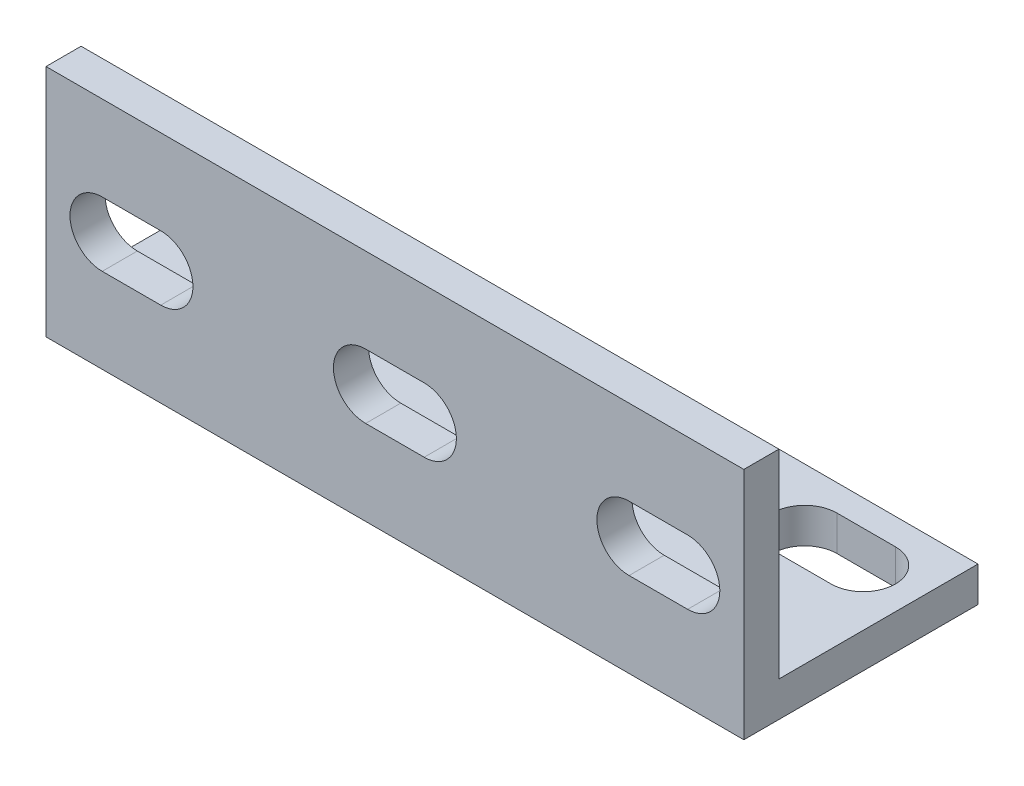
ISO-10303-21;
HEADER;
FILE_DESCRIPTION(('STEP AP214'),'2;1');
FILE_NAME('part.step','',(''),(''),'','','');
FILE_SCHEMA(('AUTOMOTIVE_DESIGN { 1 0 10303 214 1 1 1 1 }'));
ENDSEC;
DATA;
#1=APPLICATION_CONTEXT('core data for automotive mechanical design processes');
#2=APPLICATION_PROTOCOL_DEFINITION('international standard','automotive_design',2000,#1);
#3=PRODUCT_CONTEXT('',#1,'mechanical');
#4=PRODUCT('Part','Part','',(#3));
#5=PRODUCT_RELATED_PRODUCT_CATEGORY('part','',(#4));
#6=PRODUCT_DEFINITION_FORMATION('','',#4);
#7=PRODUCT_DEFINITION_CONTEXT('part definition',#1,'design');
#8=PRODUCT_DEFINITION('design','',#6,#7);
#9=PRODUCT_DEFINITION_SHAPE('','',#8);
#10=(LENGTH_UNIT() NAMED_UNIT(*) SI_UNIT(.MILLI.,.METRE.));
#11=(NAMED_UNIT(*) PLANE_ANGLE_UNIT() SI_UNIT($,.RADIAN.));
#12=(NAMED_UNIT(*) SI_UNIT($,.STERADIAN.) SOLID_ANGLE_UNIT());
#13=UNCERTAINTY_MEASURE_WITH_UNIT(LENGTH_MEASURE(1.E-05),#10,'distance_accuracy_value','');
#14=(GEOMETRIC_REPRESENTATION_CONTEXT(3) GLOBAL_UNCERTAINTY_ASSIGNED_CONTEXT((#13)) GLOBAL_UNIT_ASSIGNED_CONTEXT((#10,
#11,#12)) REPRESENTATION_CONTEXT('',''));
#15=CARTESIAN_POINT('',(0.,0.,0.));
#16=DIRECTION('',(0.,0.,1.));
#17=DIRECTION('',(1.,0.,0.));
#18=AXIS2_PLACEMENT_3D('',#15,#16,#17);
#19=CARTESIAN_POINT('',(-59.6,20.,-3.));
#20=DIRECTION('',(0.,1.,0.));
#21=DIRECTION('',(0.,0.,1.));
#22=AXIS2_PLACEMENT_3D('',#19,#20,#21);
#23=PLANE('',#22);
#24=DIRECTION('',(0.,0.,1.));
#25=VECTOR('',#24,1.);
#26=CARTESIAN_POINT('',(0.,20.,-3.));
#27=LINE('',#26,#25);
#28=CARTESIAN_POINT('',(0.,20.,-3.));
#29=VERTEX_POINT('',#28);
#30=CARTESIAN_POINT('',(0.,20.,0.));
#31=VERTEX_POINT('',#30);
#32=EDGE_CURVE('E417',#29,#31,#27,.T.);
#33=ORIENTED_EDGE('',*,*,#32,.F.);
#34=DIRECTION('',(1.,0.,0.));
#35=VECTOR('',#34,1.);
#36=CARTESIAN_POINT('',(-59.6,20.,-3.));
#37=LINE('',#36,#35);
#38=CARTESIAN_POINT('',(-59.6,20.,-3.));
#39=VERTEX_POINT('',#38);
#40=EDGE_CURVE('E11',#39,#29,#37,.T.);
#41=ORIENTED_EDGE('',*,*,#40,.F.);
#42=DIRECTION('',(0.,0.,1.));
#43=VECTOR('',#42,1.);
#44=CARTESIAN_POINT('',(-59.6,20.,-3.));
#45=LINE('',#44,#43);
#46=CARTESIAN_POINT('',(-59.6,20.,0.));
#47=VERTEX_POINT('',#46);
#48=EDGE_CURVE('E424',#39,#47,#45,.T.);
#49=ORIENTED_EDGE('',*,*,#48,.T.);
#50=DIRECTION('',(1.,0.,0.));
#51=VECTOR('',#50,1.);
#52=CARTESIAN_POINT('',(-59.6,20.,0.));
#53=LINE('',#52,#51);
#54=EDGE_CURVE('E36',#47,#31,#53,.T.);
#55=ORIENTED_EDGE('',*,*,#54,.T.);
#56=EDGE_LOOP('',(#33,#41,#49,#55));
#57=FACE_BOUND('',#56,.T.);
#58=ADVANCED_FACE('F33',(#57),#23,.T.);
#59=CARTESIAN_POINT('',(-59.6,3.,-3.));
#60=DIRECTION('',(0.,0.,-1.));
#61=DIRECTION('',(0.,1.,0.));
#62=AXIS2_PLACEMENT_3D('',#59,#60,#61);
#63=PLANE('',#62);
#64=CARTESIAN_POINT('',(-49.8,10.,-3.));
#65=DIRECTION('',(0.,0.,-1.));
#66=DIRECTION('',(0.,1.,0.));
#67=AXIS2_PLACEMENT_3D('',#64,#65,#66);
#68=CIRCLE('',#67,2.75);
#69=CARTESIAN_POINT('',(-49.8,12.75,-3.));
#70=VERTEX_POINT('',#69);
#71=CARTESIAN_POINT('',(-49.8,7.25000000000001,-3.));
#72=VERTEX_POINT('',#71);
#73=EDGE_CURVE('E324',#70,#72,#68,.T.);
#74=ORIENTED_EDGE('',*,*,#73,.F.);
#75=DIRECTION('',(-1.,0.,0.));
#76=VECTOR('',#75,1.);
#77=CARTESIAN_POINT('',(-49.8,12.75,-3.));
#78=LINE('',#77,#76);
#79=CARTESIAN_POINT('',(-54.8,12.75,-3.));
#80=VERTEX_POINT('',#79);
#81=EDGE_CURVE('E335',#70,#80,#78,.T.);
#82=ORIENTED_EDGE('',*,*,#81,.T.);
#83=CARTESIAN_POINT('',(-54.8,10.,-3.));
#84=DIRECTION('',(0.,0.,-1.));
#85=DIRECTION('',(0.,1.,0.));
#86=AXIS2_PLACEMENT_3D('',#83,#84,#85);
#87=CIRCLE('',#86,2.75);
#88=CARTESIAN_POINT('',(-54.8,7.25000000000001,-3.));
#89=VERTEX_POINT('',#88);
#90=EDGE_CURVE('E348',#89,#80,#87,.T.);
#91=ORIENTED_EDGE('',*,*,#90,.F.);
#92=DIRECTION('',(-1.,0.,0.));
#93=VECTOR('',#92,1.);
#94=CARTESIAN_POINT('',(-49.8,7.25000000000001,-3.));
#95=LINE('',#94,#93);
#96=EDGE_CURVE('E345',#72,#89,#95,.T.);
#97=ORIENTED_EDGE('',*,*,#96,.F.);
#98=EDGE_LOOP('',(#74,#82,#91,#97));
#99=FACE_BOUND('',#98,.T.);
#100=CARTESIAN_POINT('',(-4.8,10.,-3.));
#101=DIRECTION('',(0.,0.,-1.));
#102=DIRECTION('',(0.,1.,0.));
#103=AXIS2_PLACEMENT_3D('',#100,#101,#102);
#104=CIRCLE('',#103,2.75);
#105=CARTESIAN_POINT('',(-4.8,12.75,-3.));
#106=VERTEX_POINT('',#105);
#107=CARTESIAN_POINT('',(-4.80000000000001,7.25000000000001,-3.));
#108=VERTEX_POINT('',#107);
#109=EDGE_CURVE('E355',#106,#108,#104,.T.);
#110=ORIENTED_EDGE('',*,*,#109,.F.);
#111=DIRECTION('',(-1.,0.,0.));
#112=VECTOR('',#111,1.);
#113=CARTESIAN_POINT('',(-4.8,12.75,-3.));
#114=LINE('',#113,#112);
#115=CARTESIAN_POINT('',(-9.8,12.75,-3.));
#116=VERTEX_POINT('',#115);
#117=EDGE_CURVE('E366',#106,#116,#114,.T.);
#118=ORIENTED_EDGE('',*,*,#117,.T.);
#119=CARTESIAN_POINT('',(-9.8,10.,-3.));
#120=DIRECTION('',(0.,0.,-1.));
#121=DIRECTION('',(0.,1.,0.));
#122=AXIS2_PLACEMENT_3D('',#119,#120,#121);
#123=CIRCLE('',#122,2.75);
#124=CARTESIAN_POINT('',(-9.8,7.25000000000001,-3.));
#125=VERTEX_POINT('',#124);
#126=EDGE_CURVE('E379',#125,#116,#123,.T.);
#127=ORIENTED_EDGE('',*,*,#126,.F.);
#128=DIRECTION('',(-1.,0.,0.));
#129=VECTOR('',#128,1.);
#130=CARTESIAN_POINT('',(-4.8,7.25000000000001,-3.));
#131=LINE('',#130,#129);
#132=EDGE_CURVE('E376',#108,#125,#131,.T.);
#133=ORIENTED_EDGE('',*,*,#132,.F.);
#134=EDGE_LOOP('',(#110,#118,#127,#133));
#135=FACE_BOUND('',#134,.T.);
#136=CARTESIAN_POINT('',(-27.3,10.,-3.));
#137=DIRECTION('',(0.,0.,-1.));
#138=DIRECTION('',(0.,1.,0.));
#139=AXIS2_PLACEMENT_3D('',#136,#137,#138);
#140=CIRCLE('',#139,2.75);
#141=CARTESIAN_POINT('',(-27.3,12.75,-3.));
#142=VERTEX_POINT('',#141);
#143=CARTESIAN_POINT('',(-27.3,7.25000000000001,-3.));
#144=VERTEX_POINT('',#143);
#145=EDGE_CURVE('E386',#142,#144,#140,.T.);
#146=ORIENTED_EDGE('',*,*,#145,.F.);
#147=DIRECTION('',(-1.,0.,0.));
#148=VECTOR('',#147,1.);
#149=CARTESIAN_POINT('',(-27.3,12.75,-3.));
#150=LINE('',#149,#148);
#151=CARTESIAN_POINT('',(-32.3,12.75,-3.));
#152=VERTEX_POINT('',#151);
#153=EDGE_CURVE('E397',#142,#152,#150,.T.);
#154=ORIENTED_EDGE('',*,*,#153,.T.);
#155=CARTESIAN_POINT('',(-32.3,10.,-3.));
#156=DIRECTION('',(0.,0.,-1.));
#157=DIRECTION('',(0.,1.,0.));
#158=AXIS2_PLACEMENT_3D('',#155,#156,#157);
#159=CIRCLE('',#158,2.75);
#160=CARTESIAN_POINT('',(-32.3,7.25000000000001,-3.));
#161=VERTEX_POINT('',#160);
#162=EDGE_CURVE('E410',#161,#152,#159,.T.);
#163=ORIENTED_EDGE('',*,*,#162,.F.);
#164=DIRECTION('',(-1.,0.,0.));
#165=VECTOR('',#164,1.);
#166=CARTESIAN_POINT('',(-27.3,7.25000000000001,-3.));
#167=LINE('',#166,#165);
#168=EDGE_CURVE('E407',#144,#161,#167,.T.);
#169=ORIENTED_EDGE('',*,*,#168,.F.);
#170=EDGE_LOOP('',(#146,#154,#163,#169));
#171=FACE_BOUND('',#170,.T.);
#172=DIRECTION('',(0.,1.,0.));
#173=VECTOR('',#172,1.);
#174=CARTESIAN_POINT('',(0.,3.,-3.));
#175=LINE('',#174,#173);
#176=CARTESIAN_POINT('',(0.,3.,-3.));
#177=VERTEX_POINT('',#176);
#178=EDGE_CURVE('E428',#177,#29,#175,.T.);
#179=ORIENTED_EDGE('',*,*,#178,.F.);
#180=DIRECTION('',(1.,0.,0.));
#181=VECTOR('',#180,1.);
#182=CARTESIAN_POINT('',(-59.6,3.,-3.));
#183=LINE('',#182,#181);
#184=CARTESIAN_POINT('',(-59.6,3.,-3.));
#185=VERTEX_POINT('',#184);
#186=EDGE_CURVE('E41',#185,#177,#183,.T.);
#187=ORIENTED_EDGE('',*,*,#186,.F.);
#188=DIRECTION('',(0.,1.,0.));
#189=VECTOR('',#188,1.);
#190=CARTESIAN_POINT('',(-59.6,3.,-3.));
#191=LINE('',#190,#189);
#192=EDGE_CURVE('E440',#185,#39,#191,.T.);
#193=ORIENTED_EDGE('',*,*,#192,.T.);
#194=ORIENTED_EDGE('',*,*,#40,.T.);
#195=EDGE_LOOP('',(#179,#187,#193,#194));
#196=FACE_BOUND('',#195,.T.);
#197=ADVANCED_FACE('F477',(#99,#135,#171,#196),#63,.T.);
#198=CARTESIAN_POINT('',(-59.6,3.,-20.));
#199=DIRECTION('',(0.,1.,0.));
#200=DIRECTION('',(0.,0.,1.));
#201=AXIS2_PLACEMENT_3D('',#198,#199,#200);
#202=PLANE('',#201);
#203=CARTESIAN_POINT('',(-49.8,3.,-15.));
#204=DIRECTION('',(0.,1.,0.));
#205=DIRECTION('',(0.,0.,1.));
#206=AXIS2_PLACEMENT_3D('',#203,#204,#205);
#207=CIRCLE('',#206,2.75);
#208=CARTESIAN_POINT('',(-49.8,3.,-12.25));
#209=VERTEX_POINT('',#208);
#210=CARTESIAN_POINT('',(-49.8,3.,-17.75));
#211=VERTEX_POINT('',#210);
#212=EDGE_CURVE('E49',#209,#211,#207,.T.);
#213=ORIENTED_EDGE('',*,*,#212,.F.);
#214=DIRECTION('',(1.,0.,0.));
#215=VECTOR('',#214,1.);
#216=CARTESIAN_POINT('',(-49.8,3.,-12.25));
#217=LINE('',#216,#215);
#218=CARTESIAN_POINT('',(-54.8,3.,-12.25));
#219=VERTEX_POINT('',#218);
#220=EDGE_CURVE('E248',#219,#209,#217,.T.);
#221=ORIENTED_EDGE('',*,*,#220,.F.);
#222=CARTESIAN_POINT('',(-54.8,3.,-15.));
#223=DIRECTION('',(0.,1.,0.));
#224=DIRECTION('',(0.,0.,1.));
#225=AXIS2_PLACEMENT_3D('',#222,#223,#224);
#226=CIRCLE('',#225,2.75);
#227=CARTESIAN_POINT('',(-54.8,3.,-17.75));
#228=VERTEX_POINT('',#227);
#229=EDGE_CURVE('E251',#228,#219,#226,.T.);
#230=ORIENTED_EDGE('',*,*,#229,.F.);
#231=DIRECTION('',(-1.,0.,0.));
#232=VECTOR('',#231,1.);
#233=CARTESIAN_POINT('',(-49.8,3.,-17.75));
#234=LINE('',#233,#232);
#235=EDGE_CURVE('E257',#211,#228,#234,.T.);
#236=ORIENTED_EDGE('',*,*,#235,.F.);
#237=EDGE_LOOP('',(#213,#221,#230,#236));
#238=FACE_BOUND('',#237,.T.);
#239=CARTESIAN_POINT('',(-4.8,3.,-15.));
#240=DIRECTION('',(0.,1.,0.));
#241=DIRECTION('',(0.,0.,1.));
#242=AXIS2_PLACEMENT_3D('',#239,#240,#241);
#243=CIRCLE('',#242,2.75);
#244=CARTESIAN_POINT('',(-4.80000000000001,3.,-12.25));
#245=VERTEX_POINT('',#244);
#246=CARTESIAN_POINT('',(-4.80000000000001,3.,-17.75));
#247=VERTEX_POINT('',#246);
#248=EDGE_CURVE('E263',#245,#247,#243,.T.);
#249=ORIENTED_EDGE('',*,*,#248,.F.);
#250=DIRECTION('',(1.,0.,0.));
#251=VECTOR('',#250,1.);
#252=CARTESIAN_POINT('',(-4.80000000000001,3.,-12.25));
#253=LINE('',#252,#251);
#254=CARTESIAN_POINT('',(-9.8,3.,-12.25));
#255=VERTEX_POINT('',#254);
#256=EDGE_CURVE('E271',#255,#245,#253,.T.);
#257=ORIENTED_EDGE('',*,*,#256,.F.);
#258=CARTESIAN_POINT('',(-9.8,3.,-15.));
#259=DIRECTION('',(0.,1.,0.));
#260=DIRECTION('',(0.,0.,1.));
#261=AXIS2_PLACEMENT_3D('',#258,#259,#260);
#262=CIRCLE('',#261,2.75);
#263=CARTESIAN_POINT('',(-9.8,3.,-17.75));
#264=VERTEX_POINT('',#263);
#265=EDGE_CURVE('E285',#264,#255,#262,.T.);
#266=ORIENTED_EDGE('',*,*,#265,.F.);
#267=DIRECTION('',(-1.,0.,0.));
#268=VECTOR('',#267,1.);
#269=CARTESIAN_POINT('',(-4.8,3.,-17.75));
#270=LINE('',#269,#268);
#271=EDGE_CURVE('E282',#247,#264,#270,.T.);
#272=ORIENTED_EDGE('',*,*,#271,.F.);
#273=EDGE_LOOP('',(#249,#257,#266,#272));
#274=FACE_BOUND('',#273,.T.);
#275=CARTESIAN_POINT('',(-27.3,3.,-15.));
#276=DIRECTION('',(0.,1.,0.));
#277=DIRECTION('',(0.,0.,1.));
#278=AXIS2_PLACEMENT_3D('',#275,#276,#277);
#279=CIRCLE('',#278,2.75);
#280=CARTESIAN_POINT('',(-27.3,3.,-12.25));
#281=VERTEX_POINT('',#280);
#282=CARTESIAN_POINT('',(-27.3,3.,-17.75));
#283=VERTEX_POINT('',#282);
#284=EDGE_CURVE('E292',#281,#283,#279,.T.);
#285=ORIENTED_EDGE('',*,*,#284,.F.);
#286=DIRECTION('',(1.,0.,0.));
#287=VECTOR('',#286,1.);
#288=CARTESIAN_POINT('',(-27.3,3.,-12.25));
#289=LINE('',#288,#287);
#290=CARTESIAN_POINT('',(-32.3,3.,-12.25));
#291=VERTEX_POINT('',#290);
#292=EDGE_CURVE('E303',#291,#281,#289,.T.);
#293=ORIENTED_EDGE('',*,*,#292,.F.);
#294=CARTESIAN_POINT('',(-32.3,3.,-15.));
#295=DIRECTION('',(0.,1.,0.));
#296=DIRECTION('',(0.,0.,1.));
#297=AXIS2_PLACEMENT_3D('',#294,#295,#296);
#298=CIRCLE('',#297,2.75);
#299=CARTESIAN_POINT('',(-32.3,3.,-17.75));
#300=VERTEX_POINT('',#299);
#301=EDGE_CURVE('E317',#300,#291,#298,.T.);
#302=ORIENTED_EDGE('',*,*,#301,.F.);
#303=DIRECTION('',(-1.,0.,0.));
#304=VECTOR('',#303,1.);
#305=CARTESIAN_POINT('',(-27.3,3.,-17.75));
#306=LINE('',#305,#304);
#307=EDGE_CURVE('E314',#283,#300,#306,.T.);
#308=ORIENTED_EDGE('',*,*,#307,.F.);
#309=EDGE_LOOP('',(#285,#293,#302,#308));
#310=FACE_BOUND('',#309,.T.);
#311=DIRECTION('',(0.,0.,1.));
#312=VECTOR('',#311,1.);
#313=CARTESIAN_POINT('',(0.,3.,-20.));
#314=LINE('',#313,#312);
#315=CARTESIAN_POINT('',(0.,3.,-20.));
#316=VERTEX_POINT('',#315);
#317=EDGE_CURVE('E454',#316,#177,#314,.T.);
#318=ORIENTED_EDGE('',*,*,#317,.F.);
#319=DIRECTION('',(1.,0.,0.));
#320=VECTOR('',#319,1.);
#321=CARTESIAN_POINT('',(-59.6,3.,-20.));
#322=LINE('',#321,#320);
#323=CARTESIAN_POINT('',(-59.6,3.,-20.));
#324=VERTEX_POINT('',#323);
#325=EDGE_CURVE('E460',#324,#316,#322,.T.);
#326=ORIENTED_EDGE('',*,*,#325,.F.);
#327=DIRECTION('',(0.,0.,1.));
#328=VECTOR('',#327,1.);
#329=CARTESIAN_POINT('',(-59.6,3.,-20.));
#330=LINE('',#329,#328);
#331=EDGE_CURVE('E437',#324,#185,#330,.T.);
#332=ORIENTED_EDGE('',*,*,#331,.T.);
#333=ORIENTED_EDGE('',*,*,#186,.T.);
#334=EDGE_LOOP('',(#318,#326,#332,#333));
#335=FACE_BOUND('',#334,.T.);
#336=ADVANCED_FACE('F489',(#238,#274,#310,#335),#202,.T.);
#337=CARTESIAN_POINT('',(-59.6,0.,-20.));
#338=DIRECTION('',(0.,0.,-1.));
#339=DIRECTION('',(-1.,0.,0.));
#340=AXIS2_PLACEMENT_3D('',#337,#338,#339);
#341=PLANE('',#340);
#342=DIRECTION('',(0.,1.,0.));
#343=VECTOR('',#342,1.);
#344=CARTESIAN_POINT('',(0.,0.,-20.));
#345=LINE('',#344,#343);
#346=CARTESIAN_POINT('',(0.,0.,-20.));
#347=VERTEX_POINT('',#346);
#348=EDGE_CURVE('E451',#347,#316,#345,.T.);
#349=ORIENTED_EDGE('',*,*,#348,.F.);
#350=DIRECTION('',(1.,0.,0.));
#351=VECTOR('',#350,1.);
#352=CARTESIAN_POINT('',(-59.6,0.,-20.));
#353=LINE('',#352,#351);
#354=CARTESIAN_POINT('',(-59.6,0.,-20.));
#355=VERTEX_POINT('',#354);
#356=EDGE_CURVE('E462',#355,#347,#353,.T.);
#357=ORIENTED_EDGE('',*,*,#356,.F.);
#358=DIRECTION('',(0.,1.,0.));
#359=VECTOR('',#358,1.);
#360=CARTESIAN_POINT('',(-59.6,0.,-20.));
#361=LINE('',#360,#359);
#362=EDGE_CURVE('E434',#355,#324,#361,.T.);
#363=ORIENTED_EDGE('',*,*,#362,.T.);
#364=ORIENTED_EDGE('',*,*,#325,.T.);
#365=EDGE_LOOP('',(#349,#357,#363,#364));
#366=FACE_BOUND('',#365,.T.);
#367=ADVANCED_FACE('F487',(#366),#341,.T.);
#368=CARTESIAN_POINT('',(-59.6,0.,0.));
#369=DIRECTION('',(0.,-1.,0.));
#370=DIRECTION('',(0.,0.,-1.));
#371=AXIS2_PLACEMENT_3D('',#368,#369,#370);
#372=PLANE('',#371);
#373=CARTESIAN_POINT('',(-49.8,0.,-15.));
#374=DIRECTION('',(0.,1.,0.));
#375=DIRECTION('',(0.,0.,1.));
#376=AXIS2_PLACEMENT_3D('',#373,#374,#375);
#377=CIRCLE('',#376,2.75);
#378=CARTESIAN_POINT('',(-49.8,0.,-12.25));
#379=VERTEX_POINT('',#378);
#380=CARTESIAN_POINT('',(-49.8,0.,-17.75));
#381=VERTEX_POINT('',#380);
#382=EDGE_CURVE('E232',#379,#381,#377,.T.);
#383=ORIENTED_EDGE('',*,*,#382,.T.);
#384=DIRECTION('',(-1.,0.,0.));
#385=VECTOR('',#384,1.);
#386=CARTESIAN_POINT('',(-49.8,0.,-17.75));
#387=LINE('',#386,#385);
#388=CARTESIAN_POINT('',(-54.8,0.,-17.75));
#389=VERTEX_POINT('',#388);
#390=EDGE_CURVE('E241',#381,#389,#387,.T.);
#391=ORIENTED_EDGE('',*,*,#390,.T.);
#392=CARTESIAN_POINT('',(-54.8,0.,-15.));
#393=DIRECTION('',(0.,1.,0.));
#394=DIRECTION('',(0.,0.,1.));
#395=AXIS2_PLACEMENT_3D('',#392,#393,#394);
#396=CIRCLE('',#395,2.75);
#397=CARTESIAN_POINT('',(-54.8,0.,-12.25));
#398=VERTEX_POINT('',#397);
#399=EDGE_CURVE('E57',#389,#398,#396,.T.);
#400=ORIENTED_EDGE('',*,*,#399,.T.);
#401=DIRECTION('',(1.,0.,0.));
#402=VECTOR('',#401,1.);
#403=CARTESIAN_POINT('',(-49.8,0.,-12.25));
#404=LINE('',#403,#402);
#405=EDGE_CURVE('E238',#398,#379,#404,.T.);
#406=ORIENTED_EDGE('',*,*,#405,.T.);
#407=EDGE_LOOP('',(#383,#391,#400,#406));
#408=FACE_BOUND('',#407,.T.);
#409=CARTESIAN_POINT('',(-4.8,0.,-15.));
#410=DIRECTION('',(0.,1.,0.));
#411=DIRECTION('',(0.,0.,1.));
#412=AXIS2_PLACEMENT_3D('',#409,#410,#411);
#413=CIRCLE('',#412,2.75);
#414=CARTESIAN_POINT('',(-4.80000000000001,0.,-12.25));
#415=VERTEX_POINT('',#414);
#416=CARTESIAN_POINT('',(-4.8,0.,-17.75));
#417=VERTEX_POINT('',#416);
#418=EDGE_CURVE('E267',#415,#417,#413,.T.);
#419=ORIENTED_EDGE('',*,*,#418,.T.);
#420=DIRECTION('',(-1.,0.,0.));
#421=VECTOR('',#420,1.);
#422=CARTESIAN_POINT('',(-4.8,0.,-17.75));
#423=LINE('',#422,#421);
#424=CARTESIAN_POINT('',(-9.8,0.,-17.75));
#425=VERTEX_POINT('',#424);
#426=EDGE_CURVE('E270',#417,#425,#423,.T.);
#427=ORIENTED_EDGE('',*,*,#426,.T.);
#428=CARTESIAN_POINT('',(-9.8,0.,-15.));
#429=DIRECTION('',(0.,1.,0.));
#430=DIRECTION('',(0.,0.,1.));
#431=AXIS2_PLACEMENT_3D('',#428,#429,#430);
#432=CIRCLE('',#431,2.75);
#433=CARTESIAN_POINT('',(-9.8,0.,-12.25));
#434=VERTEX_POINT('',#433);
#435=EDGE_CURVE('E274',#425,#434,#432,.T.);
#436=ORIENTED_EDGE('',*,*,#435,.T.);
#437=DIRECTION('',(1.,0.,0.));
#438=VECTOR('',#437,1.);
#439=CARTESIAN_POINT('',(-4.80000000000001,0.,-12.25));
#440=LINE('',#439,#438);
#441=EDGE_CURVE('E277',#434,#415,#440,.T.);
#442=ORIENTED_EDGE('',*,*,#441,.T.);
#443=EDGE_LOOP('',(#419,#427,#436,#442));
#444=FACE_BOUND('',#443,.T.);
#445=CARTESIAN_POINT('',(-27.3,0.,-15.));
#446=DIRECTION('',(0.,1.,0.));
#447=DIRECTION('',(0.,0.,1.));
#448=AXIS2_PLACEMENT_3D('',#445,#446,#447);
#449=CIRCLE('',#448,2.75);
#450=CARTESIAN_POINT('',(-27.3,0.,-12.25));
#451=VERTEX_POINT('',#450);
#452=CARTESIAN_POINT('',(-27.3,0.,-17.75));
#453=VERTEX_POINT('',#452);
#454=EDGE_CURVE('E299',#451,#453,#449,.T.);
#455=ORIENTED_EDGE('',*,*,#454,.T.);
#456=DIRECTION('',(-1.,0.,0.));
#457=VECTOR('',#456,1.);
#458=CARTESIAN_POINT('',(-27.3,0.,-17.75));
#459=LINE('',#458,#457);
#460=CARTESIAN_POINT('',(-32.3,0.,-17.75));
#461=VERTEX_POINT('',#460);
#462=EDGE_CURVE('E302',#453,#461,#459,.T.);
#463=ORIENTED_EDGE('',*,*,#462,.T.);
#464=CARTESIAN_POINT('',(-32.3,0.,-15.));
#465=DIRECTION('',(0.,1.,0.));
#466=DIRECTION('',(0.,0.,1.));
#467=AXIS2_PLACEMENT_3D('',#464,#465,#466);
#468=CIRCLE('',#467,2.75);
#469=CARTESIAN_POINT('',(-32.3,0.,-12.25));
#470=VERTEX_POINT('',#469);
#471=EDGE_CURVE('E306',#461,#470,#468,.T.);
#472=ORIENTED_EDGE('',*,*,#471,.T.);
#473=DIRECTION('',(1.,0.,0.));
#474=VECTOR('',#473,1.);
#475=CARTESIAN_POINT('',(-27.3,0.,-12.25));
#476=LINE('',#475,#474);
#477=EDGE_CURVE('E309',#470,#451,#476,.T.);
#478=ORIENTED_EDGE('',*,*,#477,.T.);
#479=EDGE_LOOP('',(#455,#463,#472,#478));
#480=FACE_BOUND('',#479,.T.);
#481=DIRECTION('',(0.,0.,-1.));
#482=VECTOR('',#481,1.);
#483=CARTESIAN_POINT('',(0.,0.,0.));
#484=LINE('',#483,#482);
#485=CARTESIAN_POINT('',(0.,0.,0.));
#486=VERTEX_POINT('',#485);
#487=EDGE_CURVE('E448',#486,#347,#484,.T.);
#488=ORIENTED_EDGE('',*,*,#487,.F.);
#489=DIRECTION('',(1.,0.,0.));
#490=VECTOR('',#489,1.);
#491=CARTESIAN_POINT('',(-59.6,0.,0.));
#492=LINE('',#491,#490);
#493=CARTESIAN_POINT('',(-59.6,0.,0.));
#494=VERTEX_POINT('',#493);
#495=EDGE_CURVE('E463',#494,#486,#492,.T.);
#496=ORIENTED_EDGE('',*,*,#495,.F.);
#497=DIRECTION('',(0.,0.,-1.));
#498=VECTOR('',#497,1.);
#499=CARTESIAN_POINT('',(-59.6,0.,0.));
#500=LINE('',#499,#498);
#501=EDGE_CURVE('E431',#494,#355,#500,.T.);
#502=ORIENTED_EDGE('',*,*,#501,.T.);
#503=ORIENTED_EDGE('',*,*,#356,.T.);
#504=EDGE_LOOP('',(#488,#496,#502,#503));
#505=FACE_BOUND('',#504,.T.);
#506=ADVANCED_FACE('F245',(#408,#444,#480,#505),#372,.T.);
#507=CARTESIAN_POINT('',(-59.6,20.,0.));
#508=DIRECTION('',(0.,0.,1.));
#509=DIRECTION('',(0.,-1.,0.));
#510=AXIS2_PLACEMENT_3D('',#507,#508,#509);
#511=PLANE('',#510);
#512=CARTESIAN_POINT('',(-49.8,10.,0.));
#513=DIRECTION('',(0.,0.,-1.));
#514=DIRECTION('',(0.,1.,0.));
#515=AXIS2_PLACEMENT_3D('',#512,#513,#514);
#516=CIRCLE('',#515,2.75);
#517=CARTESIAN_POINT('',(-49.8,12.75,0.));
#518=VERTEX_POINT('',#517);
#519=CARTESIAN_POINT('',(-49.8,7.25000000000001,0.));
#520=VERTEX_POINT('',#519);
#521=EDGE_CURVE('E331',#518,#520,#516,.T.);
#522=ORIENTED_EDGE('',*,*,#521,.T.);
#523=DIRECTION('',(-1.,0.,0.));
#524=VECTOR('',#523,1.);
#525=CARTESIAN_POINT('',(-49.8,7.25000000000001,0.));
#526=LINE('',#525,#524);
#527=CARTESIAN_POINT('',(-54.8,7.25000000000001,0.));
#528=VERTEX_POINT('',#527);
#529=EDGE_CURVE('E334',#520,#528,#526,.T.);
#530=ORIENTED_EDGE('',*,*,#529,.T.);
#531=CARTESIAN_POINT('',(-54.8,10.,0.));
#532=DIRECTION('',(0.,0.,-1.));
#533=DIRECTION('',(0.,1.,0.));
#534=AXIS2_PLACEMENT_3D('',#531,#532,#533);
#535=CIRCLE('',#534,2.75);
#536=CARTESIAN_POINT('',(-54.8,12.75,0.));
#537=VERTEX_POINT('',#536);
#538=EDGE_CURVE('E338',#528,#537,#535,.T.);
#539=ORIENTED_EDGE('',*,*,#538,.T.);
#540=DIRECTION('',(-1.,0.,0.));
#541=VECTOR('',#540,1.);
#542=CARTESIAN_POINT('',(-49.8,12.75,0.));
#543=LINE('',#542,#541);
#544=EDGE_CURVE('E341',#518,#537,#543,.T.);
#545=ORIENTED_EDGE('',*,*,#544,.F.);
#546=EDGE_LOOP('',(#522,#530,#539,#545));
#547=FACE_BOUND('',#546,.T.);
#548=CARTESIAN_POINT('',(-4.8,10.,0.));
#549=DIRECTION('',(0.,0.,-1.));
#550=DIRECTION('',(0.,1.,0.));
#551=AXIS2_PLACEMENT_3D('',#548,#549,#550);
#552=CIRCLE('',#551,2.75);
#553=CARTESIAN_POINT('',(-4.8,12.75,0.));
#554=VERTEX_POINT('',#553);
#555=CARTESIAN_POINT('',(-4.8,7.25000000000001,0.));
#556=VERTEX_POINT('',#555);
#557=EDGE_CURVE('E362',#554,#556,#552,.T.);
#558=ORIENTED_EDGE('',*,*,#557,.T.);
#559=DIRECTION('',(-1.,0.,0.));
#560=VECTOR('',#559,1.);
#561=CARTESIAN_POINT('',(-4.8,7.25000000000001,0.));
#562=LINE('',#561,#560);
#563=CARTESIAN_POINT('',(-9.8,7.25000000000001,0.));
#564=VERTEX_POINT('',#563);
#565=EDGE_CURVE('E365',#556,#564,#562,.T.);
#566=ORIENTED_EDGE('',*,*,#565,.T.);
#567=CARTESIAN_POINT('',(-9.8,10.,0.));
#568=DIRECTION('',(0.,0.,-1.));
#569=DIRECTION('',(0.,1.,0.));
#570=AXIS2_PLACEMENT_3D('',#567,#568,#569);
#571=CIRCLE('',#570,2.75);
#572=CARTESIAN_POINT('',(-9.8,12.75,0.));
#573=VERTEX_POINT('',#572);
#574=EDGE_CURVE('E369',#564,#573,#571,.T.);
#575=ORIENTED_EDGE('',*,*,#574,.T.);
#576=DIRECTION('',(-1.,0.,0.));
#577=VECTOR('',#576,1.);
#578=CARTESIAN_POINT('',(-4.8,12.75,0.));
#579=LINE('',#578,#577);
#580=EDGE_CURVE('E372',#554,#573,#579,.T.);
#581=ORIENTED_EDGE('',*,*,#580,.F.);
#582=EDGE_LOOP('',(#558,#566,#575,#581));
#583=FACE_BOUND('',#582,.T.);
#584=CARTESIAN_POINT('',(-27.3,10.,0.));
#585=DIRECTION('',(0.,0.,-1.));
#586=DIRECTION('',(0.,1.,0.));
#587=AXIS2_PLACEMENT_3D('',#584,#585,#586);
#588=CIRCLE('',#587,2.75);
#589=CARTESIAN_POINT('',(-27.3,12.75,0.));
#590=VERTEX_POINT('',#589);
#591=CARTESIAN_POINT('',(-27.3,7.25000000000001,0.));
#592=VERTEX_POINT('',#591);
#593=EDGE_CURVE('E393',#590,#592,#588,.T.);
#594=ORIENTED_EDGE('',*,*,#593,.T.);
#595=DIRECTION('',(-1.,0.,0.));
#596=VECTOR('',#595,1.);
#597=CARTESIAN_POINT('',(-27.3,7.25000000000001,0.));
#598=LINE('',#597,#596);
#599=CARTESIAN_POINT('',(-32.3,7.25000000000001,0.));
#600=VERTEX_POINT('',#599);
#601=EDGE_CURVE('E396',#592,#600,#598,.T.);
#602=ORIENTED_EDGE('',*,*,#601,.T.);
#603=CARTESIAN_POINT('',(-32.3,10.,0.));
#604=DIRECTION('',(0.,0.,-1.));
#605=DIRECTION('',(0.,1.,0.));
#606=AXIS2_PLACEMENT_3D('',#603,#604,#605);
#607=CIRCLE('',#606,2.75);
#608=CARTESIAN_POINT('',(-32.3,12.75,0.));
#609=VERTEX_POINT('',#608);
#610=EDGE_CURVE('E400',#600,#609,#607,.T.);
#611=ORIENTED_EDGE('',*,*,#610,.T.);
#612=DIRECTION('',(-1.,0.,0.));
#613=VECTOR('',#612,1.);
#614=CARTESIAN_POINT('',(-27.3,12.75,0.));
#615=LINE('',#614,#613);
#616=EDGE_CURVE('E403',#590,#609,#615,.T.);
#617=ORIENTED_EDGE('',*,*,#616,.F.);
#618=EDGE_LOOP('',(#594,#602,#611,#617));
#619=FACE_BOUND('',#618,.T.);
#620=DIRECTION('',(0.,-1.,0.));
#621=VECTOR('',#620,1.);
#622=CARTESIAN_POINT('',(0.,20.,0.));
#623=LINE('',#622,#621);
#624=EDGE_CURVE('E445',#31,#486,#623,.T.);
#625=ORIENTED_EDGE('',*,*,#624,.F.);
#626=ORIENTED_EDGE('',*,*,#54,.F.);
#627=DIRECTION('',(0.,-1.,0.));
#628=VECTOR('',#627,1.);
#629=CARTESIAN_POINT('',(-59.6,20.,0.));
#630=LINE('',#629,#628);
#631=EDGE_CURVE('E427',#47,#494,#630,.T.);
#632=ORIENTED_EDGE('',*,*,#631,.T.);
#633=ORIENTED_EDGE('',*,*,#495,.T.);
#634=EDGE_LOOP('',(#625,#626,#632,#633));
#635=FACE_BOUND('',#634,.T.);
#636=ADVANCED_FACE('F471',(#547,#583,#619,#635),#511,.T.);
#637=CARTESIAN_POINT('',(-59.6,0.,0.));
#638=DIRECTION('',(1.,0.,0.));
#639=DIRECTION('',(0.,0.,-1.));
#640=AXIS2_PLACEMENT_3D('',#637,#638,#639);
#641=PLANE('',#640);
#642=ORIENTED_EDGE('',*,*,#48,.F.);
#643=ORIENTED_EDGE('',*,*,#192,.F.);
#644=ORIENTED_EDGE('',*,*,#331,.F.);
#645=ORIENTED_EDGE('',*,*,#362,.F.);
#646=ORIENTED_EDGE('',*,*,#501,.F.);
#647=ORIENTED_EDGE('',*,*,#631,.F.);
#648=EDGE_LOOP('',(#642,#643,#644,#645,#646,#647));
#649=FACE_BOUND('',#648,.T.);
#650=ADVANCED_FACE('F480',(#649),#641,.F.);
#651=CARTESIAN_POINT('',(0.,0.,0.));
#652=DIRECTION('',(1.,0.,0.));
#653=DIRECTION('',(0.,0.,-1.));
#654=AXIS2_PLACEMENT_3D('',#651,#652,#653);
#655=PLANE('',#654);
#656=ORIENTED_EDGE('',*,*,#32,.T.);
#657=ORIENTED_EDGE('',*,*,#624,.T.);
#658=ORIENTED_EDGE('',*,*,#487,.T.);
#659=ORIENTED_EDGE('',*,*,#348,.T.);
#660=ORIENTED_EDGE('',*,*,#317,.T.);
#661=ORIENTED_EDGE('',*,*,#178,.T.);
#662=EDGE_LOOP('',(#656,#657,#658,#659,#660,#661));
#663=FACE_BOUND('',#662,.T.);
#664=ADVANCED_FACE('F473',(#663),#655,.T.);
#665=CARTESIAN_POINT('',(-27.3,10.,0.));
#666=DIRECTION('',(0.,0.,-1.));
#667=DIRECTION('',(0.,1.,0.));
#668=AXIS2_PLACEMENT_3D('',#665,#666,#667);
#669=CYLINDRICAL_SURFACE('',#668,2.75);
#670=ORIENTED_EDGE('',*,*,#145,.T.);
#671=DIRECTION('',(0.,0.,-1.));
#672=VECTOR('',#671,1.);
#673=CARTESIAN_POINT('',(-27.3,7.25000000000001,0.));
#674=LINE('',#673,#672);
#675=EDGE_CURVE('E405',#592,#144,#674,.T.);
#676=ORIENTED_EDGE('',*,*,#675,.F.);
#677=ORIENTED_EDGE('',*,*,#593,.F.);
#678=DIRECTION('',(0.,0.,-1.));
#679=VECTOR('',#678,1.);
#680=CARTESIAN_POINT('',(-27.3,12.75,0.));
#681=LINE('',#680,#679);
#682=EDGE_CURVE('E415',#590,#142,#681,.T.);
#683=ORIENTED_EDGE('',*,*,#682,.T.);
#684=EDGE_LOOP('',(#670,#676,#677,#683));
#685=FACE_BOUND('',#684,.T.);
#686=ADVANCED_FACE('F742',(#685),#669,.F.);
#687=CARTESIAN_POINT('',(-27.3,12.75,0.));
#688=DIRECTION('',(0.,-1.,0.));
#689=DIRECTION('',(0.,0.,-1.));
#690=AXIS2_PLACEMENT_3D('',#687,#688,#689);
#691=PLANE('',#690);
#692=ORIENTED_EDGE('',*,*,#153,.F.);
#693=ORIENTED_EDGE('',*,*,#682,.F.);
#694=ORIENTED_EDGE('',*,*,#616,.T.);
#695=DIRECTION('',(0.,0.,-1.));
#696=VECTOR('',#695,1.);
#697=CARTESIAN_POINT('',(-32.3,12.75,0.));
#698=LINE('',#697,#696);
#699=EDGE_CURVE('E418',#609,#152,#698,.T.);
#700=ORIENTED_EDGE('',*,*,#699,.T.);
#701=EDGE_LOOP('',(#692,#693,#694,#700));
#702=FACE_BOUND('',#701,.T.);
#703=ADVANCED_FACE('F738',(#702),#691,.T.);
#704=CARTESIAN_POINT('',(-32.3,10.,0.));
#705=DIRECTION('',(0.,0.,-1.));
#706=DIRECTION('',(0.,1.,0.));
#707=AXIS2_PLACEMENT_3D('',#704,#705,#706);
#708=CYLINDRICAL_SURFACE('',#707,2.75);
#709=ORIENTED_EDGE('',*,*,#162,.T.);
#710=ORIENTED_EDGE('',*,*,#699,.F.);
#711=ORIENTED_EDGE('',*,*,#610,.F.);
#712=DIRECTION('',(0.,0.,-1.));
#713=VECTOR('',#712,1.);
#714=CARTESIAN_POINT('',(-32.3,7.25000000000001,0.));
#715=LINE('',#714,#713);
#716=EDGE_CURVE('E420',#600,#161,#715,.T.);
#717=ORIENTED_EDGE('',*,*,#716,.T.);
#718=EDGE_LOOP('',(#709,#710,#711,#717));
#719=FACE_BOUND('',#718,.T.);
#720=ADVANCED_FACE('F741',(#719),#708,.F.);
#721=CARTESIAN_POINT('',(-27.3,7.25000000000001,0.));
#722=DIRECTION('',(0.,-1.,0.));
#723=DIRECTION('',(1.,0.,0.));
#724=AXIS2_PLACEMENT_3D('',#721,#722,#723);
#725=PLANE('',#724);
#726=ORIENTED_EDGE('',*,*,#168,.T.);
#727=ORIENTED_EDGE('',*,*,#716,.F.);
#728=ORIENTED_EDGE('',*,*,#601,.F.);
#729=ORIENTED_EDGE('',*,*,#675,.T.);
#730=EDGE_LOOP('',(#726,#727,#728,#729));
#731=FACE_BOUND('',#730,.T.);
#732=ADVANCED_FACE('F516',(#731),#725,.F.);
#733=CARTESIAN_POINT('',(-4.8,10.,0.));
#734=DIRECTION('',(0.,0.,-1.));
#735=DIRECTION('',(0.,1.,0.));
#736=AXIS2_PLACEMENT_3D('',#733,#734,#735);
#737=CYLINDRICAL_SURFACE('',#736,2.75);
#738=ORIENTED_EDGE('',*,*,#109,.T.);
#739=DIRECTION('',(0.,0.,-1.));
#740=VECTOR('',#739,1.);
#741=CARTESIAN_POINT('',(-4.8,7.25000000000001,0.));
#742=LINE('',#741,#740);
#743=EDGE_CURVE('E374',#556,#108,#742,.T.);
#744=ORIENTED_EDGE('',*,*,#743,.F.);
#745=ORIENTED_EDGE('',*,*,#557,.F.);
#746=DIRECTION('',(0.,0.,-1.));
#747=VECTOR('',#746,1.);
#748=CARTESIAN_POINT('',(-4.8,12.75,0.));
#749=LINE('',#748,#747);
#750=EDGE_CURVE('E384',#554,#106,#749,.T.);
#751=ORIENTED_EDGE('',*,*,#750,.T.);
#752=EDGE_LOOP('',(#738,#744,#745,#751));
#753=FACE_BOUND('',#752,.T.);
#754=ADVANCED_FACE('F533',(#753),#737,.F.);
#755=CARTESIAN_POINT('',(-4.8,12.75,0.));
#756=DIRECTION('',(0.,-1.,0.));
#757=DIRECTION('',(0.,0.,-1.));
#758=AXIS2_PLACEMENT_3D('',#755,#756,#757);
#759=PLANE('',#758);
#760=ORIENTED_EDGE('',*,*,#117,.F.);
#761=ORIENTED_EDGE('',*,*,#750,.F.);
#762=ORIENTED_EDGE('',*,*,#580,.T.);
#763=DIRECTION('',(0.,0.,-1.));
#764=VECTOR('',#763,1.);
#765=CARTESIAN_POINT('',(-9.8,12.75,0.));
#766=LINE('',#765,#764);
#767=EDGE_CURVE('E387',#573,#116,#766,.T.);
#768=ORIENTED_EDGE('',*,*,#767,.T.);
#769=EDGE_LOOP('',(#760,#761,#762,#768));
#770=FACE_BOUND('',#769,.T.);
#771=ADVANCED_FACE('F538',(#770),#759,.T.);
#772=CARTESIAN_POINT('',(-9.8,10.,0.));
#773=DIRECTION('',(0.,0.,-1.));
#774=DIRECTION('',(0.,1.,0.));
#775=AXIS2_PLACEMENT_3D('',#772,#773,#774);
#776=CYLINDRICAL_SURFACE('',#775,2.75);
#777=ORIENTED_EDGE('',*,*,#126,.T.);
#778=ORIENTED_EDGE('',*,*,#767,.F.);
#779=ORIENTED_EDGE('',*,*,#574,.F.);
#780=DIRECTION('',(0.,0.,-1.));
#781=VECTOR('',#780,1.);
#782=CARTESIAN_POINT('',(-9.8,7.25000000000001,0.));
#783=LINE('',#782,#781);
#784=EDGE_CURVE('E389',#564,#125,#783,.T.);
#785=ORIENTED_EDGE('',*,*,#784,.T.);
#786=EDGE_LOOP('',(#777,#778,#779,#785));
#787=FACE_BOUND('',#786,.T.);
#788=ADVANCED_FACE('F548',(#787),#776,.F.);
#789=CARTESIAN_POINT('',(-4.8,7.25000000000001,0.));
#790=DIRECTION('',(0.,-1.,0.));
#791=DIRECTION('',(1.,0.,0.));
#792=AXIS2_PLACEMENT_3D('',#789,#790,#791);
#793=PLANE('',#792);
#794=ORIENTED_EDGE('',*,*,#132,.T.);
#795=ORIENTED_EDGE('',*,*,#784,.F.);
#796=ORIENTED_EDGE('',*,*,#565,.F.);
#797=ORIENTED_EDGE('',*,*,#743,.T.);
#798=EDGE_LOOP('',(#794,#795,#796,#797));
#799=FACE_BOUND('',#798,.T.);
#800=ADVANCED_FACE('F558',(#799),#793,.F.);
#801=CARTESIAN_POINT('',(-49.8,10.,0.));
#802=DIRECTION('',(0.,0.,-1.));
#803=DIRECTION('',(0.,1.,0.));
#804=AXIS2_PLACEMENT_3D('',#801,#802,#803);
#805=CYLINDRICAL_SURFACE('',#804,2.75);
#806=ORIENTED_EDGE('',*,*,#73,.T.);
#807=DIRECTION('',(0.,0.,-1.));
#808=VECTOR('',#807,1.);
#809=CARTESIAN_POINT('',(-49.8,7.25000000000001,0.));
#810=LINE('',#809,#808);
#811=EDGE_CURVE('E343',#520,#72,#810,.T.);
#812=ORIENTED_EDGE('',*,*,#811,.F.);
#813=ORIENTED_EDGE('',*,*,#521,.F.);
#814=DIRECTION('',(0.,0.,-1.));
#815=VECTOR('',#814,1.);
#816=CARTESIAN_POINT('',(-49.8,12.75,0.));
#817=LINE('',#816,#815);
#818=EDGE_CURVE('E353',#518,#70,#817,.T.);
#819=ORIENTED_EDGE('',*,*,#818,.T.);
#820=EDGE_LOOP('',(#806,#812,#813,#819));
#821=FACE_BOUND('',#820,.T.);
#822=ADVANCED_FACE('F568',(#821),#805,.F.);
#823=CARTESIAN_POINT('',(-49.8,12.75,0.));
#824=DIRECTION('',(0.,-1.,0.));
#825=DIRECTION('',(0.,0.,-1.));
#826=AXIS2_PLACEMENT_3D('',#823,#824,#825);
#827=PLANE('',#826);
#828=ORIENTED_EDGE('',*,*,#81,.F.);
#829=ORIENTED_EDGE('',*,*,#818,.F.);
#830=ORIENTED_EDGE('',*,*,#544,.T.);
#831=DIRECTION('',(0.,0.,-1.));
#832=VECTOR('',#831,1.);
#833=CARTESIAN_POINT('',(-54.8,12.75,0.));
#834=LINE('',#833,#832);
#835=EDGE_CURVE('E356',#537,#80,#834,.T.);
#836=ORIENTED_EDGE('',*,*,#835,.T.);
#837=EDGE_LOOP('',(#828,#829,#830,#836));
#838=FACE_BOUND('',#837,.T.);
#839=ADVANCED_FACE('F578',(#838),#827,.T.);
#840=CARTESIAN_POINT('',(-54.8,10.,0.));
#841=DIRECTION('',(0.,0.,-1.));
#842=DIRECTION('',(0.,1.,0.));
#843=AXIS2_PLACEMENT_3D('',#840,#841,#842);
#844=CYLINDRICAL_SURFACE('',#843,2.75);
#845=ORIENTED_EDGE('',*,*,#90,.T.);
#846=ORIENTED_EDGE('',*,*,#835,.F.);
#847=ORIENTED_EDGE('',*,*,#538,.F.);
#848=DIRECTION('',(0.,0.,-1.));
#849=VECTOR('',#848,1.);
#850=CARTESIAN_POINT('',(-54.8,7.25000000000001,0.));
#851=LINE('',#850,#849);
#852=EDGE_CURVE('E358',#528,#89,#851,.T.);
#853=ORIENTED_EDGE('',*,*,#852,.T.);
#854=EDGE_LOOP('',(#845,#846,#847,#853));
#855=FACE_BOUND('',#854,.T.);
#856=ADVANCED_FACE('F588',(#855),#844,.F.);
#857=CARTESIAN_POINT('',(-49.8,7.25000000000001,0.));
#858=DIRECTION('',(0.,-1.,0.));
#859=DIRECTION('',(1.,0.,0.));
#860=AXIS2_PLACEMENT_3D('',#857,#858,#859);
#861=PLANE('',#860);
#862=ORIENTED_EDGE('',*,*,#96,.T.);
#863=ORIENTED_EDGE('',*,*,#852,.F.);
#864=ORIENTED_EDGE('',*,*,#529,.F.);
#865=ORIENTED_EDGE('',*,*,#811,.T.);
#866=EDGE_LOOP('',(#862,#863,#864,#865));
#867=FACE_BOUND('',#866,.T.);
#868=ADVANCED_FACE('F598',(#867),#861,.F.);
#869=CARTESIAN_POINT('',(-27.3,0.,-15.));
#870=DIRECTION('',(0.,1.,0.));
#871=DIRECTION('',(0.,0.,1.));
#872=AXIS2_PLACEMENT_3D('',#869,#870,#871);
#873=CYLINDRICAL_SURFACE('',#872,2.75);
#874=ORIENTED_EDGE('',*,*,#284,.T.);
#875=DIRECTION('',(0.,1.,0.));
#876=VECTOR('',#875,1.);
#877=CARTESIAN_POINT('',(-27.3,0.,-17.75));
#878=LINE('',#877,#876);
#879=EDGE_CURVE('E312',#453,#283,#878,.T.);
#880=ORIENTED_EDGE('',*,*,#879,.F.);
#881=ORIENTED_EDGE('',*,*,#454,.F.);
#882=DIRECTION('',(0.,1.,0.));
#883=VECTOR('',#882,1.);
#884=CARTESIAN_POINT('',(-27.3,0.,-12.25));
#885=LINE('',#884,#883);
#886=EDGE_CURVE('E322',#451,#281,#885,.T.);
#887=ORIENTED_EDGE('',*,*,#886,.T.);
#888=EDGE_LOOP('',(#874,#880,#881,#887));
#889=FACE_BOUND('',#888,.T.);
#890=ADVANCED_FACE('F608',(#889),#873,.F.);
#891=CARTESIAN_POINT('',(-27.3,0.,-12.25));
#892=DIRECTION('',(0.,0.,1.));
#893=DIRECTION('',(0.,-1.,0.));
#894=AXIS2_PLACEMENT_3D('',#891,#892,#893);
#895=PLANE('',#894);
#896=ORIENTED_EDGE('',*,*,#292,.T.);
#897=ORIENTED_EDGE('',*,*,#886,.F.);
#898=ORIENTED_EDGE('',*,*,#477,.F.);
#899=DIRECTION('',(0.,1.,0.));
#900=VECTOR('',#899,1.);
#901=CARTESIAN_POINT('',(-32.3,0.,-12.25));
#902=LINE('',#901,#900);
#903=EDGE_CURVE('E325',#470,#291,#902,.T.);
#904=ORIENTED_EDGE('',*,*,#903,.T.);
#905=EDGE_LOOP('',(#896,#897,#898,#904));
#906=FACE_BOUND('',#905,.T.);
#907=ADVANCED_FACE('F618',(#906),#895,.F.);
#908=CARTESIAN_POINT('',(-32.3,0.,-15.));
#909=DIRECTION('',(0.,1.,0.));
#910=DIRECTION('',(0.,0.,1.));
#911=AXIS2_PLACEMENT_3D('',#908,#909,#910);
#912=CYLINDRICAL_SURFACE('',#911,2.75);
#913=ORIENTED_EDGE('',*,*,#301,.T.);
#914=ORIENTED_EDGE('',*,*,#903,.F.);
#915=ORIENTED_EDGE('',*,*,#471,.F.);
#916=DIRECTION('',(0.,1.,0.));
#917=VECTOR('',#916,1.);
#918=CARTESIAN_POINT('',(-32.3,0.,-17.75));
#919=LINE('',#918,#917);
#920=EDGE_CURVE('E327',#461,#300,#919,.T.);
#921=ORIENTED_EDGE('',*,*,#920,.T.);
#922=EDGE_LOOP('',(#913,#914,#915,#921));
#923=FACE_BOUND('',#922,.T.);
#924=ADVANCED_FACE('F628',(#923),#912,.F.);
#925=CARTESIAN_POINT('',(-27.3,0.,-17.75));
#926=DIRECTION('',(0.,0.,-1.));
#927=DIRECTION('',(0.,1.,0.));
#928=AXIS2_PLACEMENT_3D('',#925,#926,#927);
#929=PLANE('',#928);
#930=ORIENTED_EDGE('',*,*,#307,.T.);
#931=ORIENTED_EDGE('',*,*,#920,.F.);
#932=ORIENTED_EDGE('',*,*,#462,.F.);
#933=ORIENTED_EDGE('',*,*,#879,.T.);
#934=EDGE_LOOP('',(#930,#931,#932,#933));
#935=FACE_BOUND('',#934,.T.);
#936=ADVANCED_FACE('F638',(#935),#929,.F.);
#937=CARTESIAN_POINT('',(-4.8,0.,-15.));
#938=DIRECTION('',(0.,1.,0.));
#939=DIRECTION('',(0.,0.,1.));
#940=AXIS2_PLACEMENT_3D('',#937,#938,#939);
#941=CYLINDRICAL_SURFACE('',#940,2.75);
#942=ORIENTED_EDGE('',*,*,#248,.T.);
#943=DIRECTION('',(0.,1.,0.));
#944=VECTOR('',#943,1.);
#945=CARTESIAN_POINT('',(-4.8,0.,-17.75));
#946=LINE('',#945,#944);
#947=EDGE_CURVE('E280',#417,#247,#946,.T.);
#948=ORIENTED_EDGE('',*,*,#947,.F.);
#949=ORIENTED_EDGE('',*,*,#418,.F.);
#950=DIRECTION('',(0.,1.,0.));
#951=VECTOR('',#950,1.);
#952=CARTESIAN_POINT('',(-4.80000000000001,0.,-12.25));
#953=LINE('',#952,#951);
#954=EDGE_CURVE('E290',#415,#245,#953,.T.);
#955=ORIENTED_EDGE('',*,*,#954,.T.);
#956=EDGE_LOOP('',(#942,#948,#949,#955));
#957=FACE_BOUND('',#956,.T.);
#958=ADVANCED_FACE('F647',(#957),#941,.F.);
#959=CARTESIAN_POINT('',(-4.80000000000001,0.,-12.25));
#960=DIRECTION('',(0.,0.,1.));
#961=DIRECTION('',(0.,-1.,0.));
#962=AXIS2_PLACEMENT_3D('',#959,#960,#961);
#963=PLANE('',#962);
#964=ORIENTED_EDGE('',*,*,#256,.T.);
#965=ORIENTED_EDGE('',*,*,#954,.F.);
#966=ORIENTED_EDGE('',*,*,#441,.F.);
#967=DIRECTION('',(0.,1.,0.));
#968=VECTOR('',#967,1.);
#969=CARTESIAN_POINT('',(-9.8,0.,-12.25));
#970=LINE('',#969,#968);
#971=EDGE_CURVE('E293',#434,#255,#970,.T.);
#972=ORIENTED_EDGE('',*,*,#971,.T.);
#973=EDGE_LOOP('',(#964,#965,#966,#972));
#974=FACE_BOUND('',#973,.T.);
#975=ADVANCED_FACE('F668',(#974),#963,.F.);
#976=CARTESIAN_POINT('',(-9.8,0.,-15.));
#977=DIRECTION('',(0.,1.,0.));
#978=DIRECTION('',(0.,0.,1.));
#979=AXIS2_PLACEMENT_3D('',#976,#977,#978);
#980=CYLINDRICAL_SURFACE('',#979,2.75);
#981=ORIENTED_EDGE('',*,*,#265,.T.);
#982=ORIENTED_EDGE('',*,*,#971,.F.);
#983=ORIENTED_EDGE('',*,*,#435,.F.);
#984=DIRECTION('',(0.,1.,0.));
#985=VECTOR('',#984,1.);
#986=CARTESIAN_POINT('',(-9.8,0.,-17.75));
#987=LINE('',#986,#985);
#988=EDGE_CURVE('E295',#425,#264,#987,.T.);
#989=ORIENTED_EDGE('',*,*,#988,.T.);
#990=EDGE_LOOP('',(#981,#982,#983,#989));
#991=FACE_BOUND('',#990,.T.);
#992=ADVANCED_FACE('F678',(#991),#980,.F.);
#993=CARTESIAN_POINT('',(-4.8,0.,-17.75));
#994=DIRECTION('',(0.,0.,-1.));
#995=DIRECTION('',(0.,1.,0.));
#996=AXIS2_PLACEMENT_3D('',#993,#994,#995);
#997=PLANE('',#996);
#998=ORIENTED_EDGE('',*,*,#271,.T.);
#999=ORIENTED_EDGE('',*,*,#988,.F.);
#1000=ORIENTED_EDGE('',*,*,#426,.F.);
#1001=ORIENTED_EDGE('',*,*,#947,.T.);
#1002=EDGE_LOOP('',(#998,#999,#1000,#1001));
#1003=FACE_BOUND('',#1002,.T.);
#1004=ADVANCED_FACE('F688',(#1003),#997,.F.);
#1005=CARTESIAN_POINT('',(-49.8,0.,-15.));
#1006=DIRECTION('',(0.,1.,0.));
#1007=DIRECTION('',(0.,0.,1.));
#1008=AXIS2_PLACEMENT_3D('',#1005,#1006,#1007);
#1009=CYLINDRICAL_SURFACE('',#1008,2.75);
#1010=ORIENTED_EDGE('',*,*,#212,.T.);
#1011=DIRECTION('',(0.,1.,0.));
#1012=VECTOR('',#1011,1.);
#1013=CARTESIAN_POINT('',(-49.8,0.,-17.75));
#1014=LINE('',#1013,#1012);
#1015=EDGE_CURVE('E228',#381,#211,#1014,.T.);
#1016=ORIENTED_EDGE('',*,*,#1015,.F.);
#1017=ORIENTED_EDGE('',*,*,#382,.F.);
#1018=DIRECTION('',(0.,1.,0.));
#1019=VECTOR('',#1018,1.);
#1020=CARTESIAN_POINT('',(-49.8,0.,-12.25));
#1021=LINE('',#1020,#1019);
#1022=EDGE_CURVE('E261',#379,#209,#1021,.T.);
#1023=ORIENTED_EDGE('',*,*,#1022,.T.);
#1024=EDGE_LOOP('',(#1010,#1016,#1017,#1023));
#1025=FACE_BOUND('',#1024,.T.);
#1026=ADVANCED_FACE('F230',(#1025),#1009,.F.);
#1027=CARTESIAN_POINT('',(-49.8,0.,-12.25));
#1028=DIRECTION('',(0.,0.,1.));
#1029=DIRECTION('',(0.,-1.,0.));
#1030=AXIS2_PLACEMENT_3D('',#1027,#1028,#1029);
#1031=PLANE('',#1030);
#1032=ORIENTED_EDGE('',*,*,#220,.T.);
#1033=ORIENTED_EDGE('',*,*,#1022,.F.);
#1034=ORIENTED_EDGE('',*,*,#405,.F.);
#1035=DIRECTION('',(0.,1.,0.));
#1036=VECTOR('',#1035,1.);
#1037=CARTESIAN_POINT('',(-54.8,0.,-12.25));
#1038=LINE('',#1037,#1036);
#1039=EDGE_CURVE('E264',#398,#219,#1038,.T.);
#1040=ORIENTED_EDGE('',*,*,#1039,.T.);
#1041=EDGE_LOOP('',(#1032,#1033,#1034,#1040));
#1042=FACE_BOUND('',#1041,.T.);
#1043=ADVANCED_FACE('F707',(#1042),#1031,.F.);
#1044=CARTESIAN_POINT('',(-54.8,0.,-15.));
#1045=DIRECTION('',(0.,1.,0.));
#1046=DIRECTION('',(0.,0.,1.));
#1047=AXIS2_PLACEMENT_3D('',#1044,#1045,#1046);
#1048=CYLINDRICAL_SURFACE('',#1047,2.75);
#1049=ORIENTED_EDGE('',*,*,#229,.T.);
#1050=ORIENTED_EDGE('',*,*,#1039,.F.);
#1051=ORIENTED_EDGE('',*,*,#399,.F.);
#1052=DIRECTION('',(0.,1.,0.));
#1053=VECTOR('',#1052,1.);
#1054=CARTESIAN_POINT('',(-54.8,0.,-17.75));
#1055=LINE('',#1054,#1053);
#1056=EDGE_CURVE('E237',#389,#228,#1055,.T.);
#1057=ORIENTED_EDGE('',*,*,#1056,.T.);
#1058=EDGE_LOOP('',(#1049,#1050,#1051,#1057));
#1059=FACE_BOUND('',#1058,.T.);
#1060=ADVANCED_FACE('F716',(#1059),#1048,.F.);
#1061=CARTESIAN_POINT('',(-49.8,0.,-17.75));
#1062=DIRECTION('',(0.,0.,-1.));
#1063=DIRECTION('',(0.,1.,0.));
#1064=AXIS2_PLACEMENT_3D('',#1061,#1062,#1063);
#1065=PLANE('',#1064);
#1066=ORIENTED_EDGE('',*,*,#235,.T.);
#1067=ORIENTED_EDGE('',*,*,#1056,.F.);
#1068=ORIENTED_EDGE('',*,*,#390,.F.);
#1069=ORIENTED_EDGE('',*,*,#1015,.T.);
#1070=EDGE_LOOP('',(#1066,#1067,#1068,#1069));
#1071=FACE_BOUND('',#1070,.T.);
#1072=ADVANCED_FACE('F242',(#1071),#1065,.F.);
#1073=CLOSED_SHELL('',(#58,#197,#336,#367,#506,#636,#650,#664,#686,#703,#720,#732,#754,#771,
#788,#800,#822,#839,#856,#868,#890,#907,#924,#936,#958,#975,#992,#1004,#1026,#1043,#1060,#1072));
#1074=MANIFOLD_SOLID_BREP('B2',#1073);
#1075=ADVANCED_BREP_SHAPE_REPRESENTATION('',(#18,#1074),#14);
#1076=SHAPE_DEFINITION_REPRESENTATION(#9,#1075);
ENDSEC;
END-ISO-10303-21;
